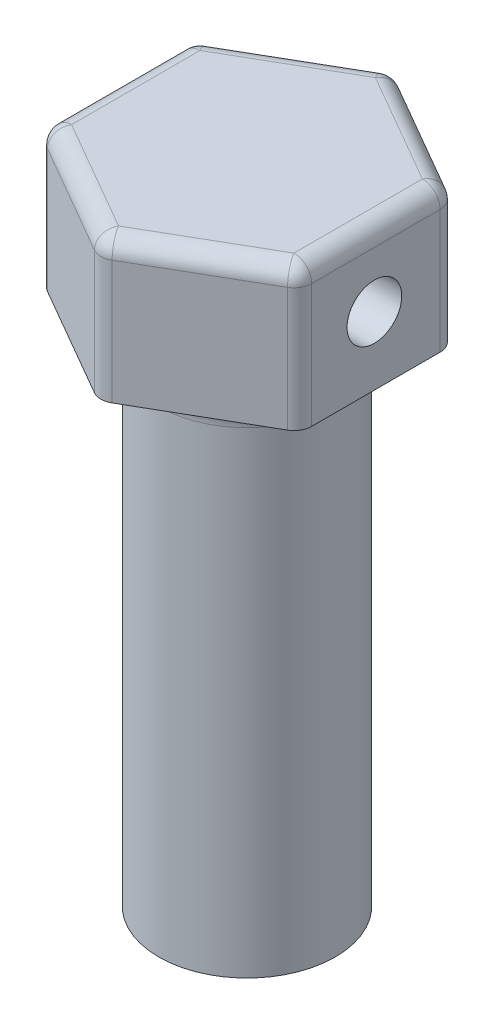
ISO-10303-21;
HEADER;
FILE_DESCRIPTION(('STEP AP214'),'2;1');
FILE_NAME('part.step','',(''),(''),'','','');
FILE_SCHEMA(('AUTOMOTIVE_DESIGN { 1 0 10303 214 1 1 1 1 }'));
ENDSEC;
DATA;
#1=APPLICATION_CONTEXT('core data for automotive mechanical design processes');
#2=APPLICATION_PROTOCOL_DEFINITION('international standard','automotive_design',2000,#1);
#3=PRODUCT_CONTEXT('',#1,'mechanical');
#4=PRODUCT('Part','Part','',(#3));
#5=PRODUCT_RELATED_PRODUCT_CATEGORY('part','',(#4));
#6=PRODUCT_DEFINITION_FORMATION('','',#4);
#7=PRODUCT_DEFINITION_CONTEXT('part definition',#1,'design');
#8=PRODUCT_DEFINITION('design','',#6,#7);
#9=PRODUCT_DEFINITION_SHAPE('','',#8);
#10=(LENGTH_UNIT() NAMED_UNIT(*) SI_UNIT(.MILLI.,.METRE.));
#11=(NAMED_UNIT(*) PLANE_ANGLE_UNIT() SI_UNIT($,.RADIAN.));
#12=(NAMED_UNIT(*) SI_UNIT($,.STERADIAN.) SOLID_ANGLE_UNIT());
#13=UNCERTAINTY_MEASURE_WITH_UNIT(LENGTH_MEASURE(1.E-05),#10,'distance_accuracy_value','');
#14=(GEOMETRIC_REPRESENTATION_CONTEXT(3) GLOBAL_UNCERTAINTY_ASSIGNED_CONTEXT((#13)) GLOBAL_UNIT_ASSIGNED_CONTEXT((#10,
#11,#12)) REPRESENTATION_CONTEXT('',''));
#15=CARTESIAN_POINT('',(0.,0.,0.));
#16=DIRECTION('',(0.,0.,1.));
#17=DIRECTION('',(1.,0.,0.));
#18=AXIS2_PLACEMENT_3D('',#15,#16,#17);
#19=CARTESIAN_POINT('',(-1.5,-29.,1.45177692845699));
#20=DIRECTION('',(1.,0.,0.));
#21=DIRECTION('',(0.,0.,-1.));
#22=AXIS2_PLACEMENT_3D('',#19,#20,#21);
#23=PLANE('',#22);
#24=DIRECTION('',(0.,1.,0.));
#25=VECTOR('',#24,1.);
#26=CARTESIAN_POINT('',(-1.5,-29.,1.45177692845699));
#27=LINE('',#26,#25);
#28=CARTESIAN_POINT('',(-1.5,-26.,1.45177692845699));
#29=VERTEX_POINT('',#28);
#30=CARTESIAN_POINT('',(-1.5,0.,1.45177692845699));
#31=VERTEX_POINT('',#30);
#32=EDGE_CURVE('E176',#29,#31,#27,.T.);
#33=ORIENTED_EDGE('',*,*,#32,.F.);
#34=DIRECTION('',(0.,0.,-1.));
#35=VECTOR('',#34,1.);
#36=CARTESIAN_POINT('',(-1.5,-26.,1.45177692845699));
#37=LINE('',#36,#35);
#38=CARTESIAN_POINT('',(-1.5,-26.,-1.45177692845699));
#39=VERTEX_POINT('',#38);
#40=EDGE_CURVE('E12',#29,#39,#37,.T.);
#41=ORIENTED_EDGE('',*,*,#40,.T.);
#42=DIRECTION('',(0.,1.,0.));
#43=VECTOR('',#42,1.);
#44=CARTESIAN_POINT('',(-1.5,-29.,-1.45177692845699));
#45=LINE('',#44,#43);
#46=CARTESIAN_POINT('',(-1.5,0.,-1.45177692845699));
#47=VERTEX_POINT('',#46);
#48=EDGE_CURVE('E178',#39,#47,#45,.T.);
#49=ORIENTED_EDGE('',*,*,#48,.T.);
#50=DIRECTION('',(0.,0.,-1.));
#51=VECTOR('',#50,1.);
#52=CARTESIAN_POINT('',(-1.5,0.,1.45177692845699));
#53=LINE('',#52,#51);
#54=EDGE_CURVE('E184',#31,#47,#53,.T.);
#55=ORIENTED_EDGE('',*,*,#54,.F.);
#56=EDGE_LOOP('',(#33,#41,#49,#55));
#57=FACE_BOUND('',#56,.T.);
#58=ADVANCED_FACE('F51',(#57),#23,.T.);
#59=CARTESIAN_POINT('',(0.,0.,0.));
#60=DIRECTION('',(0.,1.,0.));
#61=DIRECTION('',(0.,0.,1.));
#62=AXIS2_PLACEMENT_3D('',#59,#60,#61);
#63=PLANE('',#62);
#64=CARTESIAN_POINT('',(0.,0.,0.));
#65=DIRECTION('',(0.,1.,0.));
#66=DIRECTION('',(0.,0.,1.));
#67=AXIS2_PLACEMENT_3D('',#64,#65,#66);
#68=CIRCLE('',#67,7.);
#69=CARTESIAN_POINT('',(0.,0.,7.));
#70=VERTEX_POINT('',#69);
#71=EDGE_CURVE('E224',#70,#70,#68,.T.);
#72=ORIENTED_EDGE('',*,*,#71,.T.);
#73=EDGE_LOOP('',(#72));
#74=FACE_BOUND('',#73,.T.);
#75=DIRECTION('',(0.,0.,1.));
#76=VECTOR('',#75,1.);
#77=CARTESIAN_POINT('',(-7.3,0.,-4.21465696508427));
#78=LINE('',#77,#76);
#79=CARTESIAN_POINT('',(-7.3,0.,-3.63730669589464));
#80=VERTEX_POINT('',#79);
#81=CARTESIAN_POINT('',(-7.3,0.,3.63730669589464));
#82=VERTEX_POINT('',#81);
#83=EDGE_CURVE('E212',#80,#82,#78,.T.);
#84=ORIENTED_EDGE('',*,*,#83,.F.);
#85=CARTESIAN_POINT('',(-6.3,0.,-3.63730669589464));
#86=DIRECTION('',(0.,1.,0.));
#87=DIRECTION('',(0.,0.,1.));
#88=AXIS2_PLACEMENT_3D('',#85,#86,#87);
#89=CIRCLE('',#88,1.);
#90=CARTESIAN_POINT('',(-6.8,0.,-4.50333209967908));
#91=VERTEX_POINT('',#90);
#92=EDGE_CURVE('E60',#80,#91,#89,.F.);
#93=ORIENTED_EDGE('',*,*,#92,.T.);
#94=DIRECTION('',(-0.866025403784439,0.,0.5));
#95=VECTOR('',#94,1.);
#96=CARTESIAN_POINT('',(0.,0.,-8.42931393016854));
#97=LINE('',#96,#95);
#98=CARTESIAN_POINT('',(-0.5,0.,-8.14063879557373));
#99=VERTEX_POINT('',#98);
#100=EDGE_CURVE('E208',#99,#91,#97,.T.);
#101=ORIENTED_EDGE('',*,*,#100,.F.);
#102=CARTESIAN_POINT('',(0.,0.,-7.27461339178929));
#103=DIRECTION('',(0.,1.,0.));
#104=DIRECTION('',(0.,0.,1.));
#105=AXIS2_PLACEMENT_3D('',#102,#103,#104);
#106=CIRCLE('',#105,1.);
#107=CARTESIAN_POINT('',(0.5,0.,-8.14063879557372));
#108=VERTEX_POINT('',#107);
#109=EDGE_CURVE('E313',#99,#108,#106,.F.);
#110=ORIENTED_EDGE('',*,*,#109,.T.);
#111=DIRECTION('',(-0.866025403784439,0.,-0.5));
#112=VECTOR('',#111,1.);
#113=CARTESIAN_POINT('',(7.3,0.,-4.21465696508427));
#114=LINE('',#113,#112);
#115=CARTESIAN_POINT('',(6.8,0.,-4.50333209967908));
#116=VERTEX_POINT('',#115);
#117=EDGE_CURVE('E204',#116,#108,#114,.T.);
#118=ORIENTED_EDGE('',*,*,#117,.F.);
#119=CARTESIAN_POINT('',(6.3,0.,-3.63730669589465));
#120=DIRECTION('',(0.,1.,0.));
#121=DIRECTION('',(0.,0.,1.));
#122=AXIS2_PLACEMENT_3D('',#119,#120,#121);
#123=CIRCLE('',#122,1.);
#124=CARTESIAN_POINT('',(7.3,0.,-3.63730669589465));
#125=VERTEX_POINT('',#124);
#126=EDGE_CURVE('E310',#116,#125,#123,.F.);
#127=ORIENTED_EDGE('',*,*,#126,.T.);
#128=DIRECTION('',(0.,0.,-1.));
#129=VECTOR('',#128,1.);
#130=CARTESIAN_POINT('',(7.3,0.,4.21465696508427));
#131=LINE('',#130,#129);
#132=CARTESIAN_POINT('',(7.3,0.,3.63730669589464));
#133=VERTEX_POINT('',#132);
#134=EDGE_CURVE('E200',#133,#125,#131,.T.);
#135=ORIENTED_EDGE('',*,*,#134,.F.);
#136=CARTESIAN_POINT('',(6.3,0.,3.63730669589464));
#137=DIRECTION('',(0.,1.,0.));
#138=DIRECTION('',(0.,0.,1.));
#139=AXIS2_PLACEMENT_3D('',#136,#137,#138);
#140=CIRCLE('',#139,1.);
#141=CARTESIAN_POINT('',(6.8,0.,4.50333209967908));
#142=VERTEX_POINT('',#141);
#143=EDGE_CURVE('E307',#133,#142,#140,.F.);
#144=ORIENTED_EDGE('',*,*,#143,.T.);
#145=DIRECTION('',(0.866025403784439,0.,-0.5));
#146=VECTOR('',#145,1.);
#147=CARTESIAN_POINT('',(0.,0.,8.42931393016854));
#148=LINE('',#147,#146);
#149=CARTESIAN_POINT('',(0.500000000000001,0.,8.14063879557373));
#150=VERTEX_POINT('',#149);
#151=EDGE_CURVE('E192',#150,#142,#148,.T.);
#152=ORIENTED_EDGE('',*,*,#151,.F.);
#153=CARTESIAN_POINT('',(0.,0.,7.27461339178929));
#154=DIRECTION('',(0.,1.,0.));
#155=DIRECTION('',(0.,0.,1.));
#156=AXIS2_PLACEMENT_3D('',#153,#154,#155);
#157=CIRCLE('',#156,1.);
#158=CARTESIAN_POINT('',(-0.5,0.,8.14063879557373));
#159=VERTEX_POINT('',#158);
#160=EDGE_CURVE('E304',#150,#159,#157,.F.);
#161=ORIENTED_EDGE('',*,*,#160,.T.);
#162=DIRECTION('',(0.866025403784438,0.,0.5));
#163=VECTOR('',#162,1.);
#164=CARTESIAN_POINT('',(-7.3,0.,4.21465696508427));
#165=LINE('',#164,#163);
#166=CARTESIAN_POINT('',(-6.8,0.,4.50333209967908));
#167=VERTEX_POINT('',#166);
#168=EDGE_CURVE('E216',#167,#159,#165,.T.);
#169=ORIENTED_EDGE('',*,*,#168,.F.);
#170=CARTESIAN_POINT('',(-6.3,0.,3.63730669589464));
#171=DIRECTION('',(0.,1.,0.));
#172=DIRECTION('',(0.,0.,1.));
#173=AXIS2_PLACEMENT_3D('',#170,#171,#172);
#174=CIRCLE('',#173,1.);
#175=EDGE_CURVE('E301',#167,#82,#174,.F.);
#176=ORIENTED_EDGE('',*,*,#175,.T.);
#177=EDGE_LOOP('',(#84,#93,#101,#110,#118,#127,#135,#144,#152,#161,#169,#176));
#178=FACE_BOUND('',#177,.T.);
#179=ADVANCED_FACE('F411',(#74,#178),#63,.F.);
#180=CARTESIAN_POINT('',(0.,8.,8.42931393016854));
#181=DIRECTION('',(-0.5,0.,-0.866025403784439));
#182=DIRECTION('',(-0.866025403784439,0.,0.5));
#183=AXIS2_PLACEMENT_3D('',#180,#181,#182);
#184=PLANE('',#183);
#185=ORIENTED_EDGE('',*,*,#151,.T.);
#186=DIRECTION('',(0.,-1.,0.));
#187=VECTOR('',#186,1.);
#188=CARTESIAN_POINT('',(6.8,8.,4.50333209967908));
#189=LINE('',#188,#187);
#190=CARTESIAN_POINT('',(6.8,7.,4.50333209967908));
#191=VERTEX_POINT('',#190);
#192=EDGE_CURVE('E73',#142,#191,#189,.F.);
#193=ORIENTED_EDGE('',*,*,#192,.T.);
#194=DIRECTION('',(0.866025403784439,0.,-0.5));
#195=VECTOR('',#194,1.);
#196=CARTESIAN_POINT('',(0.,7.,8.42931393016854));
#197=LINE('',#196,#195);
#198=CARTESIAN_POINT('',(0.5,7.,8.14063879557373));
#199=VERTEX_POINT('',#198);
#200=EDGE_CURVE('E296',#191,#199,#197,.F.);
#201=ORIENTED_EDGE('',*,*,#200,.T.);
#202=DIRECTION('',(0.,-1.,0.));
#203=VECTOR('',#202,1.);
#204=CARTESIAN_POINT('',(0.5,8.,8.14063879557373));
#205=LINE('',#204,#203);
#206=EDGE_CURVE('E293',#199,#150,#205,.T.);
#207=ORIENTED_EDGE('',*,*,#206,.T.);
#208=EDGE_LOOP('',(#185,#193,#201,#207));
#209=FACE_BOUND('',#208,.T.);
#210=ADVANCED_FACE('F427',(#209),#184,.F.);
#211=CARTESIAN_POINT('',(7.3,8.,4.21465696508427));
#212=DIRECTION('',(-1.,0.,0.));
#213=DIRECTION('',(0.,0.,1.));
#214=AXIS2_PLACEMENT_3D('',#211,#212,#213);
#215=PLANE('',#214);
#216=CARTESIAN_POINT('',(7.3,3.85,0.0853430349157284));
#217=DIRECTION('',(1.,0.,0.));
#218=DIRECTION('',(0.,0.,-1.));
#219=AXIS2_PLACEMENT_3D('',#216,#217,#218);
#220=CIRCLE('',#219,1.55);
#221=CARTESIAN_POINT('',(7.3,3.85,-1.46465696508427));
#222=VERTEX_POINT('',#221);
#223=EDGE_CURVE('E385',#222,#222,#220,.T.);
#224=ORIENTED_EDGE('',*,*,#223,.F.);
#225=EDGE_LOOP('',(#224));
#226=FACE_BOUND('',#225,.T.);
#227=ORIENTED_EDGE('',*,*,#134,.T.);
#228=DIRECTION('',(0.,-1.,0.));
#229=VECTOR('',#228,1.);
#230=CARTESIAN_POINT('',(7.3,8.,-3.63730669589465));
#231=LINE('',#230,#229);
#232=CARTESIAN_POINT('',(7.3,7.,-3.63730669589465));
#233=VERTEX_POINT('',#232);
#234=EDGE_CURVE('E290',#125,#233,#231,.F.);
#235=ORIENTED_EDGE('',*,*,#234,.T.);
#236=DIRECTION('',(0.,0.,-1.));
#237=VECTOR('',#236,1.);
#238=CARTESIAN_POINT('',(7.3,7.,4.21465696508427));
#239=LINE('',#238,#237);
#240=CARTESIAN_POINT('',(7.3,7.,3.63730669589464));
#241=VERTEX_POINT('',#240);
#242=EDGE_CURVE('E287',#233,#241,#239,.F.);
#243=ORIENTED_EDGE('',*,*,#242,.T.);
#244=DIRECTION('',(0.,-1.,0.));
#245=VECTOR('',#244,1.);
#246=CARTESIAN_POINT('',(7.3,8.,3.63730669589464));
#247=LINE('',#246,#245);
#248=EDGE_CURVE('E284',#241,#133,#247,.T.);
#249=ORIENTED_EDGE('',*,*,#248,.T.);
#250=EDGE_LOOP('',(#227,#235,#243,#249));
#251=FACE_BOUND('',#250,.T.);
#252=ADVANCED_FACE('F492',(#226,#251),#215,.F.);
#253=CARTESIAN_POINT('',(7.3,8.,-4.21465696508427));
#254=DIRECTION('',(-0.5,0.,0.866025403784439));
#255=DIRECTION('',(0.866025403784439,0.,0.5));
#256=AXIS2_PLACEMENT_3D('',#253,#254,#255);
#257=PLANE('',#256);
#258=CARTESIAN_POINT('',(3.65,3.5,-6.3219854476264));
#259=DIRECTION('',(0.5,0.,-0.866025403784439));
#260=DIRECTION('',(-0.866025403784439,0.,-0.5));
#261=AXIS2_PLACEMENT_3D('',#258,#259,#260);
#262=CIRCLE('',#261,0.5);
#263=CARTESIAN_POINT('',(3.21698729810778,3.5,-6.5719854476264));
#264=VERTEX_POINT('',#263);
#265=EDGE_CURVE('E823',#264,#264,#262,.T.);
#266=ORIENTED_EDGE('',*,*,#265,.F.);
#267=EDGE_LOOP('',(#266));
#268=FACE_BOUND('',#267,.T.);
#269=ORIENTED_EDGE('',*,*,#117,.T.);
#270=DIRECTION('',(0.,-1.,0.));
#271=VECTOR('',#270,1.);
#272=CARTESIAN_POINT('',(0.5,8.,-8.14063879557372));
#273=LINE('',#272,#271);
#274=CARTESIAN_POINT('',(0.499999999999999,7.,-8.14063879557372));
#275=VERTEX_POINT('',#274);
#276=EDGE_CURVE('E281',#108,#275,#273,.F.);
#277=ORIENTED_EDGE('',*,*,#276,.T.);
#278=DIRECTION('',(-0.866025403784439,0.,-0.5));
#279=VECTOR('',#278,1.);
#280=CARTESIAN_POINT('',(7.3,7.,-4.21465696508427));
#281=LINE('',#280,#279);
#282=CARTESIAN_POINT('',(6.8,7.,-4.50333209967908));
#283=VERTEX_POINT('',#282);
#284=EDGE_CURVE('E278',#275,#283,#281,.F.);
#285=ORIENTED_EDGE('',*,*,#284,.T.);
#286=DIRECTION('',(0.,-1.,0.));
#287=VECTOR('',#286,1.);
#288=CARTESIAN_POINT('',(6.8,8.,-4.50333209967908));
#289=LINE('',#288,#287);
#290=EDGE_CURVE('E275',#283,#116,#289,.T.);
#291=ORIENTED_EDGE('',*,*,#290,.T.);
#292=EDGE_LOOP('',(#269,#277,#285,#291));
#293=FACE_BOUND('',#292,.T.);
#294=ADVANCED_FACE('F540',(#268,#293),#257,.F.);
#295=CARTESIAN_POINT('',(0.,8.,-8.42931393016854));
#296=DIRECTION('',(0.5,0.,0.866025403784439));
#297=DIRECTION('',(0.866025403784439,0.,-0.5));
#298=AXIS2_PLACEMENT_3D('',#295,#296,#297);
#299=PLANE('',#298);
#300=ORIENTED_EDGE('',*,*,#100,.T.);
#301=DIRECTION('',(0.,-1.,0.));
#302=VECTOR('',#301,1.);
#303=CARTESIAN_POINT('',(-6.8,8.,-4.50333209967908));
#304=LINE('',#303,#302);
#305=CARTESIAN_POINT('',(-6.8,7.,-4.50333209967908));
#306=VERTEX_POINT('',#305);
#307=EDGE_CURVE('E272',#91,#306,#304,.F.);
#308=ORIENTED_EDGE('',*,*,#307,.T.);
#309=DIRECTION('',(-0.866025403784439,0.,0.5));
#310=VECTOR('',#309,1.);
#311=CARTESIAN_POINT('',(0.,7.,-8.42931393016854));
#312=LINE('',#311,#310);
#313=CARTESIAN_POINT('',(-0.500000000000001,7.,-8.14063879557373));
#314=VERTEX_POINT('',#313);
#315=EDGE_CURVE('E269',#306,#314,#312,.F.);
#316=ORIENTED_EDGE('',*,*,#315,.T.);
#317=DIRECTION('',(0.,-1.,0.));
#318=VECTOR('',#317,1.);
#319=CARTESIAN_POINT('',(-0.500000000000001,8.,-8.14063879557373));
#320=LINE('',#319,#318);
#321=EDGE_CURVE('E266',#314,#99,#320,.T.);
#322=ORIENTED_EDGE('',*,*,#321,.T.);
#323=EDGE_LOOP('',(#300,#308,#316,#322));
#324=FACE_BOUND('',#323,.T.);
#325=ADVANCED_FACE('F590',(#324),#299,.F.);
#326=CARTESIAN_POINT('',(-7.3,8.,-4.21465696508427));
#327=DIRECTION('',(1.,0.,0.));
#328=DIRECTION('',(0.,0.,-1.));
#329=AXIS2_PLACEMENT_3D('',#326,#327,#328);
#330=PLANE('',#329);
#331=CARTESIAN_POINT('',(-7.3,3.85,0.0853430349157314));
#332=DIRECTION('',(1.,0.,0.));
#333=DIRECTION('',(0.,0.,-1.));
#334=AXIS2_PLACEMENT_3D('',#331,#332,#333);
#335=CIRCLE('',#334,1.55);
#336=CARTESIAN_POINT('',(-7.3,3.85,-1.46465696508427));
#337=VERTEX_POINT('',#336);
#338=EDGE_CURVE('E391',#337,#337,#335,.T.);
#339=ORIENTED_EDGE('',*,*,#338,.T.);
#340=EDGE_LOOP('',(#339));
#341=FACE_BOUND('',#340,.T.);
#342=DIRECTION('',(0.,0.,1.));
#343=VECTOR('',#342,1.);
#344=CARTESIAN_POINT('',(-7.3,7.,-4.21465696508427));
#345=LINE('',#344,#343);
#346=CARTESIAN_POINT('',(-7.3,7.,3.63730669589464));
#347=VERTEX_POINT('',#346);
#348=CARTESIAN_POINT('',(-7.3,7.,-3.63730669589464));
#349=VERTEX_POINT('',#348);
#350=EDGE_CURVE('E260',#347,#349,#345,.F.);
#351=ORIENTED_EDGE('',*,*,#350,.T.);
#352=DIRECTION('',(0.,-1.,0.));
#353=VECTOR('',#352,1.);
#354=CARTESIAN_POINT('',(-7.3,8.,-3.63730669589464));
#355=LINE('',#354,#353);
#356=EDGE_CURVE('E263',#349,#80,#355,.T.);
#357=ORIENTED_EDGE('',*,*,#356,.T.);
#358=ORIENTED_EDGE('',*,*,#83,.T.);
#359=DIRECTION('',(0.,-1.,0.));
#360=VECTOR('',#359,1.);
#361=CARTESIAN_POINT('',(-7.3,8.,3.63730669589464));
#362=LINE('',#361,#360);
#363=EDGE_CURVE('E257',#82,#347,#362,.F.);
#364=ORIENTED_EDGE('',*,*,#363,.T.);
#365=EDGE_LOOP('',(#351,#357,#358,#364));
#366=FACE_BOUND('',#365,.T.);
#367=ADVANCED_FACE('F449',(#341,#366),#330,.F.);
#368=CARTESIAN_POINT('',(-7.3,8.,4.21465696508427));
#369=DIRECTION('',(0.5,0.,-0.866025403784439));
#370=DIRECTION('',(-0.866025403784438,0.,-0.5));
#371=AXIS2_PLACEMENT_3D('',#368,#369,#370);
#372=PLANE('',#371);
#373=ORIENTED_EDGE('',*,*,#168,.T.);
#374=DIRECTION('',(0.,-1.,0.));
#375=VECTOR('',#374,1.);
#376=CARTESIAN_POINT('',(-0.5,8.,8.14063879557373));
#377=LINE('',#376,#375);
#378=CARTESIAN_POINT('',(-0.5,7.,8.14063879557373));
#379=VERTEX_POINT('',#378);
#380=EDGE_CURVE('E254',#159,#379,#377,.F.);
#381=ORIENTED_EDGE('',*,*,#380,.T.);
#382=DIRECTION('',(0.866025403784438,0.,0.5));
#383=VECTOR('',#382,1.);
#384=CARTESIAN_POINT('',(-7.3,7.,4.21465696508427));
#385=LINE('',#384,#383);
#386=CARTESIAN_POINT('',(-6.8,7.,4.50333209967908));
#387=VERTEX_POINT('',#386);
#388=EDGE_CURVE('E250',#379,#387,#385,.F.);
#389=ORIENTED_EDGE('',*,*,#388,.T.);
#390=DIRECTION('',(0.,-1.,0.));
#391=VECTOR('',#390,1.);
#392=CARTESIAN_POINT('',(-6.8,8.,4.50333209967908));
#393=LINE('',#392,#391);
#394=EDGE_CURVE('E247',#387,#167,#393,.T.);
#395=ORIENTED_EDGE('',*,*,#394,.T.);
#396=EDGE_LOOP('',(#373,#381,#389,#395));
#397=FACE_BOUND('',#396,.T.);
#398=ADVANCED_FACE('F444',(#397),#372,.F.);
#399=CARTESIAN_POINT('',(0.,8.,0.));
#400=DIRECTION('',(0.,1.,0.));
#401=DIRECTION('',(0.,0.,1.));
#402=AXIS2_PLACEMENT_3D('',#399,#400,#401);
#403=PLANE('',#402);
#404=DIRECTION('',(0.,0.,1.));
#405=VECTOR('',#404,1.);
#406=CARTESIAN_POINT('',(-6.3,8.,4.21465696508427));
#407=LINE('',#406,#405);
#408=CARTESIAN_POINT('',(-6.3,8.,-3.63730669589464));
#409=VERTEX_POINT('',#408);
#410=CARTESIAN_POINT('',(-6.3,8.,3.63730669589464));
#411=VERTEX_POINT('',#410);
#412=EDGE_CURVE('E240',#409,#411,#407,.T.);
#413=ORIENTED_EDGE('',*,*,#412,.T.);
#414=DIRECTION('',(0.866025403784438,0.,0.5));
#415=VECTOR('',#414,1.);
#416=CARTESIAN_POINT('',(0.499999999999999,8.,7.5632885263841));
#417=LINE('',#416,#415);
#418=CARTESIAN_POINT('',(0.,8.,7.27461339178929));
#419=VERTEX_POINT('',#418);
#420=EDGE_CURVE('E243',#411,#419,#417,.T.);
#421=ORIENTED_EDGE('',*,*,#420,.T.);
#422=DIRECTION('',(0.866025403784439,0.,-0.5));
#423=VECTOR('',#422,1.);
#424=CARTESIAN_POINT('',(6.8,8.,3.34863156129983));
#425=LINE('',#424,#423);
#426=CARTESIAN_POINT('',(6.3,8.,3.63730669589465));
#427=VERTEX_POINT('',#426);
#428=EDGE_CURVE('E228',#419,#427,#425,.T.);
#429=ORIENTED_EDGE('',*,*,#428,.T.);
#430=DIRECTION('',(0.,0.,-1.));
#431=VECTOR('',#430,1.);
#432=CARTESIAN_POINT('',(6.3,8.,-4.21465696508427));
#433=LINE('',#432,#431);
#434=CARTESIAN_POINT('',(6.3,8.,-3.63730669589465));
#435=VERTEX_POINT('',#434);
#436=EDGE_CURVE('E231',#427,#435,#433,.T.);
#437=ORIENTED_EDGE('',*,*,#436,.T.);
#438=DIRECTION('',(-0.866025403784439,0.,-0.5));
#439=VECTOR('',#438,1.);
#440=CARTESIAN_POINT('',(-0.500000000000001,8.,-7.5632885263841));
#441=LINE('',#440,#439);
#442=CARTESIAN_POINT('',(0.,8.,-7.27461339178929));
#443=VERTEX_POINT('',#442);
#444=EDGE_CURVE('E234',#435,#443,#441,.T.);
#445=ORIENTED_EDGE('',*,*,#444,.T.);
#446=DIRECTION('',(-0.866025403784439,0.,0.5));
#447=VECTOR('',#446,1.);
#448=CARTESIAN_POINT('',(-6.8,8.,-3.34863156129983));
#449=LINE('',#448,#447);
#450=EDGE_CURVE('E237',#443,#409,#449,.T.);
#451=ORIENTED_EDGE('',*,*,#450,.T.);
#452=EDGE_LOOP('',(#413,#421,#429,#437,#445,#451));
#453=FACE_BOUND('',#452,.T.);
#454=ADVANCED_FACE('F439',(#453),#403,.T.);
#455=CARTESIAN_POINT('',(0.,-29.,0.));
#456=DIRECTION('',(0.,-1.,0.));
#457=DIRECTION('',(0.,0.,-1.));
#458=AXIS2_PLACEMENT_3D('',#455,#456,#457);
#459=PLANE('',#458);
#460=CARTESIAN_POINT('',(0.,-29.,0.));
#461=DIRECTION('',(0.,-1.,0.));
#462=DIRECTION('',(0.,0.,-1.));
#463=AXIS2_PLACEMENT_3D('',#460,#461,#462);
#464=CIRCLE('',#463,2.0875);
#465=CARTESIAN_POINT('',(0.,-29.,-2.0875));
#466=VERTEX_POINT('',#465);
#467=EDGE_CURVE('E194',#466,#466,#464,.T.);
#468=ORIENTED_EDGE('',*,*,#467,.F.);
#469=EDGE_LOOP('',(#468));
#470=FACE_BOUND('',#469,.T.);
#471=CARTESIAN_POINT('',(0.,-29.,0.));
#472=DIRECTION('',(0.,-1.,0.));
#473=DIRECTION('',(0.,0.,-1.));
#474=AXIS2_PLACEMENT_3D('',#471,#472,#473);
#475=CIRCLE('',#474,5.);
#476=CARTESIAN_POINT('',(0.,-29.,-5.));
#477=VERTEX_POINT('',#476);
#478=EDGE_CURVE('E187',#477,#477,#475,.T.);
#479=ORIENTED_EDGE('',*,*,#478,.T.);
#480=EDGE_LOOP('',(#479));
#481=FACE_BOUND('',#480,.T.);
#482=ADVANCED_FACE('F436',(#470,#481),#459,.T.);
#483=CARTESIAN_POINT('',(0.,-29.,0.));
#484=DIRECTION('',(0.,1.,0.));
#485=DIRECTION('',(0.,0.,1.));
#486=AXIS2_PLACEMENT_3D('',#483,#484,#485);
#487=CYLINDRICAL_SURFACE('',#486,5.);
#488=CARTESIAN_POINT('',(0.,-2.,0.));
#489=DIRECTION('',(0.,1.,0.));
#490=DIRECTION('',(0.,0.,1.));
#491=AXIS2_PLACEMENT_3D('',#488,#489,#490);
#492=CIRCLE('',#491,5.);
#493=CARTESIAN_POINT('',(0.,-2.,5.));
#494=VERTEX_POINT('',#493);
#495=EDGE_CURVE('E220',#494,#494,#492,.F.);
#496=ORIENTED_EDGE('',*,*,#495,.T.);
#497=EDGE_LOOP('',(#496));
#498=FACE_BOUND('',#497,.T.);
#499=ORIENTED_EDGE('',*,*,#478,.F.);
#500=EDGE_LOOP('',(#499));
#501=FACE_BOUND('',#500,.T.);
#502=ADVANCED_FACE('F421',(#498,#501),#487,.T.);
#503=CARTESIAN_POINT('',(0.,-29.,0.));
#504=DIRECTION('',(0.,1.,0.));
#505=DIRECTION('',(0.,0.,1.));
#506=AXIS2_PLACEMENT_3D('',#503,#504,#505);
#507=CYLINDRICAL_SURFACE('',#506,2.0875);
#508=CARTESIAN_POINT('',(0.,-26.,0.));
#509=DIRECTION('',(0.,-1.,0.));
#510=DIRECTION('',(0.,0.,-1.));
#511=AXIS2_PLACEMENT_3D('',#508,#509,#510);
#512=CIRCLE('',#511,2.0875);
#513=EDGE_CURVE('E66',#29,#39,#512,.T.);
#514=ORIENTED_EDGE('',*,*,#513,.F.);
#515=ORIENTED_EDGE('',*,*,#32,.T.);
#516=CARTESIAN_POINT('',(0.,0.,0.));
#517=DIRECTION('',(0.,-1.,0.));
#518=DIRECTION('',(0.,0.,-1.));
#519=AXIS2_PLACEMENT_3D('',#516,#517,#518);
#520=CIRCLE('',#519,2.0875);
#521=EDGE_CURVE('E397',#47,#31,#520,.T.);
#522=ORIENTED_EDGE('',*,*,#521,.F.);
#523=ORIENTED_EDGE('',*,*,#48,.F.);
#524=EDGE_LOOP('',(#514,#515,#522,#523));
#525=FACE_BOUND('',#524,.T.);
#526=ORIENTED_EDGE('',*,*,#467,.T.);
#527=EDGE_LOOP('',(#526));
#528=FACE_BOUND('',#527,.T.);
#529=ADVANCED_FACE('F173',(#525,#528),#507,.F.);
#530=CARTESIAN_POINT('',(0.,0.,0.));
#531=DIRECTION('',(0.,-1.,0.));
#532=DIRECTION('',(0.,0.,-1.));
#533=AXIS2_PLACEMENT_3D('',#530,#531,#532);
#534=CIRCLE('',#533,1.25);
#535=CARTESIAN_POINT('',(0.,0.,-1.25));
#536=VERTEX_POINT('',#535);
#537=EDGE_CURVE('E818',#536,#536,#534,.T.);
#538=ORIENTED_EDGE('',*,*,#537,.F.);
#539=EDGE_LOOP('',(#538));
#540=FACE_BOUND('',#539,.T.);
#541=ORIENTED_EDGE('',*,*,#54,.T.);
#542=ORIENTED_EDGE('',*,*,#521,.T.);
#543=EDGE_LOOP('',(#541,#542));
#544=FACE_BOUND('',#543,.T.);
#545=ADVANCED_FACE('F406',(#540,#544),#63,.F.);
#546=CARTESIAN_POINT('',(0.,-2.,0.));
#547=DIRECTION('',(0.,1.,0.));
#548=DIRECTION('',(0.,0.,1.));
#549=AXIS2_PLACEMENT_3D('',#546,#547,#548);
#550=TOROIDAL_SURFACE('',#549,7.,2.);
#551=ORIENTED_EDGE('',*,*,#71,.F.);
#552=EDGE_LOOP('',(#551));
#553=FACE_BOUND('',#552,.T.);
#554=ORIENTED_EDGE('',*,*,#495,.F.);
#555=EDGE_LOOP('',(#554));
#556=FACE_BOUND('',#555,.T.);
#557=ADVANCED_FACE('F408',(#553,#556),#550,.F.);
#558=CARTESIAN_POINT('',(-7.3,3.85,0.0853430349157314));
#559=DIRECTION('',(1.,0.,0.));
#560=DIRECTION('',(0.,0.,-1.));
#561=AXIS2_PLACEMENT_3D('',#558,#559,#560);
#562=CYLINDRICAL_SURFACE('',#561,1.55);
#563=CARTESIAN_POINT('',(0.,3.06300636654288,-1.25));
#564=CARTESIAN_POINT('',(-0.041301602564252,3.06299111492104,-1.24999440582926));
#565=CARTESIAN_POINT('',(-0.0826622150684468,3.0594538669413,-1.24792546989775));
#566=CARTESIAN_POINT('',(-0.164001472993008,3.04604216997584,-1.23987619935768));
#567=CARTESIAN_POINT('',(-0.203974352426859,3.0361439988587,-1.2338812215485));
#568=CARTESIAN_POINT('',(-0.297768283430284,3.0066629309098,-1.21530713048835));
#569=CARTESIAN_POINT('',(-0.350500531746376,2.98476935700799,-1.20103218379735));
#570=CARTESIAN_POINT('',(-0.451616903849389,2.93591949181999,-1.16679545456734));
#571=CARTESIAN_POINT('',(-0.499985468125294,2.90894606685875,-1.14681430439653));
#572=CARTESIAN_POINT('',(-0.582825744681604,2.85868688918029,-1.10654884109417));
#573=CARTESIAN_POINT('',(-0.618055934314941,2.83584766769323,-1.08724493279857));
#574=CARTESIAN_POINT('',(-0.686226700680422,2.78955837602196,-1.04555763913344));
#575=CARTESIAN_POINT('',(-0.719166048979597,2.76610798723252,-1.02317262043568));
#576=CARTESIAN_POINT('',(-0.814571303194274,2.69589232391681,-0.951475007372201));
#577=CARTESIAN_POINT('',(-0.873750007842423,2.64918109284241,-0.897558288556876));
#578=CARTESIAN_POINT('',(-0.971488906178606,2.56890613771982,-0.789257858005671));
#579=CARTESIAN_POINT('',(-1.01181688646501,2.53456002585319,-0.737037213084417));
#580=CARTESIAN_POINT('',(-1.08471295560267,2.47073866753222,-0.624786077485593));
#581=CARTESIAN_POINT('',(-1.11729471450697,2.44125486897378,-0.564769638274936));
#582=CARTESIAN_POINT('',(-1.167641642544,2.39422627473518,-0.44974479942497));
#583=CARTESIAN_POINT('',(-1.18704559294464,2.37547748483155,-0.39595023001308));
#584=CARTESIAN_POINT('',(-1.21853292020641,2.34369335632691,-0.284631892689434));
#585=CARTESIAN_POINT('',(-1.23062054965173,2.33065469995304,-0.227110312656472));
#586=CARTESIAN_POINT('',(-1.24661326429393,2.31113649235983,-0.109509199862149));
#587=CARTESIAN_POINT('',(-1.25047520310349,2.30469161886726,-0.0494178574345837));
#588=CARTESIAN_POINT('',(-1.24943138675887,2.29889486219123,0.0710290436026361));
#589=CARTESIAN_POINT('',(-1.24452751099986,2.29954145874558,0.131384542809408));
#590=CARTESIAN_POINT('',(-1.22695347852354,2.30729911417111,0.24518809568316));
#591=CARTESIAN_POINT('',(-1.21498195318294,2.31385367785997,0.298786010533986));
#592=CARTESIAN_POINT('',(-1.1844500714156,2.33200739719698,0.403158403366509));
#593=CARTESIAN_POINT('',(-1.16588828894205,2.34360764478855,0.453932267507391));
#594=CARTESIAN_POINT('',(-1.12158352847451,2.37180931066153,0.554771879228037));
#595=CARTESIAN_POINT('',(-1.09546489770609,2.38867750288334,0.604595997769054));
#596=CARTESIAN_POINT('',(-1.03753278519779,2.42589667043423,0.699367532517902));
#597=CARTESIAN_POINT('',(-1.00571686210665,2.44624913864812,0.744312844790786));
#598=CARTESIAN_POINT('',(-0.930754373015022,2.49321878202419,0.836883641045511));
#599=CARTESIAN_POINT('',(-0.886600835684749,2.52029754043777,0.883457693130686));
#600=CARTESIAN_POINT('',(-0.792086036047711,2.57561506085479,0.969110902997212));
#601=CARTESIAN_POINT('',(-0.741716379711889,2.60385535630042,1.00817974002343));
#602=CARTESIAN_POINT('',(-0.635250560153108,2.65909387309691,1.07843523226006));
#603=CARTESIAN_POINT('',(-0.579163389493455,2.68609395092517,1.10963400500563));
#604=CARTESIAN_POINT('',(-0.461317477328724,2.73586502755761,1.16355750147167));
#605=CARTESIAN_POINT('',(-0.399570339829453,2.75864440204024,1.18629910020061));
#606=CARTESIAN_POINT('',(-0.289023624094293,2.79073586882606,1.21707218664435));
#607=CARTESIAN_POINT('',(-0.241465831680964,2.80203371981421,1.22744190826755));
#608=CARTESIAN_POINT('',(-0.144498249650106,2.81877586710317,1.24258476451287));
#609=CARTESIAN_POINT('',(-0.0950924232428492,2.82423202135642,1.24736923831762));
#610=CARTESIAN_POINT('',(0.00445642144024292,2.82834265658563,1.25098724929806));
#611=CARTESIAN_POINT('',(0.0546017283901357,2.82696706996175,1.24979447944687));
#612=CARTESIAN_POINT('',(0.153795785432793,2.8176118512109,1.24150447845168));
#613=CARTESIAN_POINT('',(0.202842926001359,2.80962310395748,1.23439909770023));
#614=CARTESIAN_POINT('',(0.310586008250744,2.78571905625046,1.21234188476512));
#615=CARTESIAN_POINT('',(0.368630837493627,2.7683219786457,1.1958731423359));
#616=CARTESIAN_POINT('',(0.480287315114382,2.72844194014306,1.15558131462972));
#617=CARTESIAN_POINT('',(0.533885920465583,2.7059446917523,1.13173749928649));
#618=CARTESIAN_POINT('',(0.652788790300151,2.65097323161605,1.06875051004666));
#619=CARTESIAN_POINT('',(0.716378614292974,2.61760460231739,1.02715323487059));
#620=CARTESIAN_POINT('',(0.835116282947256,2.55115023144684,0.933169083235592));
#621=CARTESIAN_POINT('',(0.890267871057291,2.51806437061705,0.880787015560401));
#622=CARTESIAN_POINT('',(0.982774695823851,2.4608378561669,0.775072838146119));
#623=CARTESIAN_POINT('',(1.0215650415802,2.43612088674925,0.723313160391291));
#624=CARTESIAN_POINT('',(1.0913329560333,2.39135839845994,0.612973520335291));
#625=CARTESIAN_POINT('',(1.12232277536251,2.37130555844017,0.55440446627615));
#626=CARTESIAN_POINT('',(1.1708427785569,2.34048718437041,0.441339820015366));
#627=CARTESIAN_POINT('',(1.18973442532783,2.32874801210213,0.387697084794267));
#628=CARTESIAN_POINT('',(1.22015766134809,2.31094012641843,0.27744961897616));
#629=CARTESIAN_POINT('',(1.23169327074564,2.30486831489064,0.220846524578993));
#630=CARTESIAN_POINT('',(1.24684031414995,2.29907071043569,0.106065229892042));
#631=CARTESIAN_POINT('',(1.25042577912291,2.29936568093521,0.0478824942578681));
#632=CARTESIAN_POINT('',(1.24949319540504,2.30651245072849,-0.0680101134761316));
#633=CARTESIAN_POINT('',(1.24497467785291,2.31336462938319,-0.125719958022474));
#634=CARTESIAN_POINT('',(1.22871845036683,2.33269715741431,-0.236012488907826));
#635=CARTESIAN_POINT('',(1.21736023392209,2.34487300838407,-0.288706600122438));
#636=CARTESIAN_POINT('',(1.18847929897974,2.37403431774048,-0.390952244104959));
#637=CARTESIAN_POINT('',(1.17095479350189,2.39102117006857,-0.440502860975093));
#638=CARTESIAN_POINT('',(1.12351482384541,2.43556264214724,-0.552337811219016));
#639=CARTESIAN_POINT('',(1.09140957041027,2.46473751619082,-0.613050051710613));
#640=CARTESIAN_POINT('',(1.01929496938293,2.52812615839134,-0.726698595015945));
#641=CARTESIAN_POINT('',(0.97926642826102,2.56235211012177,-0.779615460251271));
#642=CARTESIAN_POINT('',(0.882047019739425,2.6425460023073,-0.889447540206268));
#643=CARTESIAN_POINT('',(0.823052922014887,2.68933873555993,-0.944176584708209));
#644=CARTESIAN_POINT('',(0.727904353195899,2.75980071328673,-1.016979341121));
#645=CARTESIAN_POINT('',(0.695069980266153,2.78333915701303,-1.03970276240477));
#646=CARTESIAN_POINT('',(0.62710543645588,2.82986774709269,-1.08205409680024));
#647=CARTESIAN_POINT('',(0.591976629500797,2.85285820829624,-1.10168382568988));
#648=CARTESIAN_POINT('',(0.514960296474335,2.9001062764203,-1.13990369364796));
#649=CARTESIAN_POINT('',(0.472765383445809,2.9241905799731,-1.15809414892484));
#650=CARTESIAN_POINT('',(0.385000888161593,2.96887691161605,-1.19014711585965));
#651=CARTESIAN_POINT('',(0.339436094087831,2.98948374905308,-1.20401562764763));
#652=CARTESIAN_POINT('',(0.254778861108675,3.02087449148682,-1.22436136834602));
#653=CARTESIAN_POINT('',(0.21635456554201,3.03281405524104,-1.23178134440185));
#654=CARTESIAN_POINT('',(0.137748348571973,3.05119434659299,-1.24301384722023));
#655=CARTESIAN_POINT('',(0.0975734929845747,3.0576553532976,-1.24683968356819));
#656=CARTESIAN_POINT('',(0.0381123091281284,3.06227018461342,-1.24956562801693));
#657=CARTESIAN_POINT('',(0.0190624397530193,3.06301340581265,-1.25000258194685));
#658=CARTESIAN_POINT('',(0.,3.06300636654288,-1.25));
#659=B_SPLINE_CURVE_WITH_KNOTS('',3,(#563,#564,#565,#566,#567,#568,#569,#570,#571,#572,#573,
#574,#575,#576,#577,#578,#579,#580,#581,#582,#583,#584,#585,#586,#587,#588,#589,#590,#591,#592,
#593,#594,#595,#596,#597,#598,#599,#600,#601,#602,#603,#604,#605,#606,#607,#608,#609,#610,#611,
#612,#613,#614,#615,#616,#617,#618,#619,#620,#621,#622,#623,#624,#625,#626,#627,#628,#629,#630,
#631,#632,#633,#634,#635,#636,#637,#638,#639,#640,#641,#642,#643,#644,#645,#646,#647,#648,#649,
#650,#651,#652,#653,#654,#655,#656,#657,#658),.UNSPECIFIED.,.T.,.F.,(4,2,2,2,2,2,2,2,2,2,2,2,2,
2,2,2,2,2,2,2,2,2,2,2,2,2,2,2,2,2,2,2,2,2,2,2,2,2,2,2,2,2,2,2,2,2,2,4),(0.,0.123830746205279,
0.248126002330307,0.423690056025674,0.599857228286685,0.738315252366816,0.876846959196072,
1.15343026564869,1.37579976761269,1.59777388333968,1.77758833210166,1.95729816376851,
2.13794833311325,2.31855977561389,2.48375484721279,2.64898568670622,2.82452086182519,
3.00013143644635,3.20834316302664,3.41683919276093,3.62501221439853,3.8327676007825,
3.98210140065395,4.1311314925218,4.28081806972682,4.43071130882835,4.61805634751958,
4.80593284139443,5.05369427590659,5.30134547548596,5.50827605835075,5.71487960261002,
5.88835283740074,6.06173118589376,6.23567504313533,6.40962896433913,6.57472115629126,
6.7398612311419,6.96249015098085,7.18566512124171,7.46341028088888,7.60234905269665,
7.74120597114662,7.89653808312062,8.05165357769554,8.17397631813597,8.2958442743642,
8.35299741110841),.UNSPECIFIED.);
#660=CARTESIAN_POINT('',(0.,3.06300636654288,-1.25));
#661=VERTEX_POINT('',#660);
#662=EDGE_CURVE('E181',#661,#661,#659,.T.);
#663=ORIENTED_EDGE('',*,*,#662,.F.);
#664=EDGE_LOOP('',(#663));
#665=FACE_BOUND('',#664,.T.);
#666=ORIENTED_EDGE('',*,*,#338,.F.);
#667=EDGE_LOOP('',(#666));
#668=FACE_BOUND('',#667,.T.);
#669=ORIENTED_EDGE('',*,*,#223,.T.);
#670=EDGE_LOOP('',(#669));
#671=FACE_BOUND('',#670,.T.);
#672=ADVANCED_FACE('F417',(#665,#668,#671),#562,.F.);
#673=CARTESIAN_POINT('',(0.,8.,-7.27461339178929));
#674=DIRECTION('',(0.,-1.,0.));
#675=DIRECTION('',(0.,0.,-1.));
#676=AXIS2_PLACEMENT_3D('',#673,#674,#675);
#677=CYLINDRICAL_SURFACE('',#676,1.);
#678=ORIENTED_EDGE('',*,*,#109,.F.);
#679=ORIENTED_EDGE('',*,*,#321,.F.);
#680=CARTESIAN_POINT('',(0.,7.,-7.27461339178929));
#681=DIRECTION('',(0.,1.,0.));
#682=DIRECTION('',(0.,0.,1.));
#683=AXIS2_PLACEMENT_3D('',#680,#681,#682);
#684=CIRCLE('',#683,1.);
#685=EDGE_CURVE('E382',#275,#314,#684,.T.);
#686=ORIENTED_EDGE('',*,*,#685,.F.);
#687=ORIENTED_EDGE('',*,*,#276,.F.);
#688=EDGE_LOOP('',(#678,#679,#686,#687));
#689=FACE_BOUND('',#688,.T.);
#690=ADVANCED_FACE('F53',(#689),#677,.T.);
#691=CARTESIAN_POINT('',(3.15,7.,-5.45596004384197));
#692=DIRECTION('',(0.866025403784439,0.,0.5));
#693=DIRECTION('',(0.5,0.,-0.866025403784439));
#694=AXIS2_PLACEMENT_3D('',#691,#692,#693);
#695=CYLINDRICAL_SURFACE('',#694,1.);
#696=CARTESIAN_POINT('',(6.3,7.,-3.63730669589465));
#697=DIRECTION('',(0.866025403784439,0.,0.5));
#698=DIRECTION('',(0.5,0.,-0.866025403784439));
#699=AXIS2_PLACEMENT_3D('',#696,#697,#698);
#700=CIRCLE('',#699,1.);
#701=EDGE_CURVE('E375',#283,#435,#700,.T.);
#702=ORIENTED_EDGE('',*,*,#701,.F.);
#703=ORIENTED_EDGE('',*,*,#284,.F.);
#704=CARTESIAN_POINT('',(0.,7.,-7.27461339178929));
#705=DIRECTION('',(-0.866025403784438,0.,-0.5));
#706=DIRECTION('',(-0.5,0.,0.866025403784439));
#707=AXIS2_PLACEMENT_3D('',#704,#705,#706);
#708=CIRCLE('',#707,1.);
#709=EDGE_CURVE('E379',#443,#275,#708,.T.);
#710=ORIENTED_EDGE('',*,*,#709,.F.);
#711=ORIENTED_EDGE('',*,*,#444,.F.);
#712=EDGE_LOOP('',(#702,#703,#710,#711));
#713=FACE_BOUND('',#712,.T.);
#714=ADVANCED_FACE('F508',(#713),#695,.T.);
#715=CARTESIAN_POINT('',(6.3,8.,-3.63730669589465));
#716=DIRECTION('',(0.,-1.,0.));
#717=DIRECTION('',(0.,0.,-1.));
#718=AXIS2_PLACEMENT_3D('',#715,#716,#717);
#719=CYLINDRICAL_SURFACE('',#718,1.);
#720=ORIENTED_EDGE('',*,*,#126,.F.);
#721=ORIENTED_EDGE('',*,*,#290,.F.);
#722=CARTESIAN_POINT('',(6.3,7.,-3.63730669589465));
#723=DIRECTION('',(0.,1.,0.));
#724=DIRECTION('',(0.,0.,1.));
#725=AXIS2_PLACEMENT_3D('',#722,#723,#724);
#726=CIRCLE('',#725,1.);
#727=EDGE_CURVE('E371',#233,#283,#726,.T.);
#728=ORIENTED_EDGE('',*,*,#727,.F.);
#729=ORIENTED_EDGE('',*,*,#234,.F.);
#730=EDGE_LOOP('',(#720,#721,#728,#729));
#731=FACE_BOUND('',#730,.T.);
#732=ADVANCED_FACE('F501',(#731),#719,.T.);
#733=CARTESIAN_POINT('',(0.,7.,-7.27461339178929));
#734=DIRECTION('',(0.,1.,0.));
#735=DIRECTION('',(-1.,0.,0.));
#736=AXIS2_PLACEMENT_3D('',#733,#734,#735);
#737=SPHERICAL_SURFACE('',#736,1.);
#738=ORIENTED_EDGE('',*,*,#709,.T.);
#739=ORIENTED_EDGE('',*,*,#685,.T.);
#740=CARTESIAN_POINT('',(0.,7.,-7.27461339178929));
#741=DIRECTION('',(0.866025403784439,0.,-0.5));
#742=DIRECTION('',(-0.5,0.,-0.866025403784439));
#743=AXIS2_PLACEMENT_3D('',#740,#741,#742);
#744=CIRCLE('',#743,1.);
#745=EDGE_CURVE('E367',#443,#314,#744,.F.);
#746=ORIENTED_EDGE('',*,*,#745,.F.);
#747=EDGE_LOOP('',(#738,#739,#746));
#748=FACE_BOUND('',#747,.T.);
#749=ADVANCED_FACE('F510',(#748),#737,.T.);
#750=CARTESIAN_POINT('',(6.3,7.,-3.63730669589465));
#751=DIRECTION('',(0.,1.,0.));
#752=DIRECTION('',(0.,0.,1.));
#753=AXIS2_PLACEMENT_3D('',#750,#751,#752);
#754=SPHERICAL_SURFACE('',#753,1.);
#755=ORIENTED_EDGE('',*,*,#727,.T.);
#756=ORIENTED_EDGE('',*,*,#701,.T.);
#757=CARTESIAN_POINT('',(6.3,7.,-3.63730669589465));
#758=DIRECTION('',(0.,0.,-1.));
#759=DIRECTION('',(-1.,0.,0.));
#760=AXIS2_PLACEMENT_3D('',#757,#758,#759);
#761=CIRCLE('',#760,1.);
#762=EDGE_CURVE('E363',#233,#435,#761,.F.);
#763=ORIENTED_EDGE('',*,*,#762,.F.);
#764=EDGE_LOOP('',(#755,#756,#763));
#765=FACE_BOUND('',#764,.T.);
#766=ADVANCED_FACE('F505',(#765),#754,.T.);
#767=CARTESIAN_POINT('',(-6.3,8.,-3.63730669589464));
#768=DIRECTION('',(0.,-1.,0.));
#769=DIRECTION('',(0.,0.,-1.));
#770=AXIS2_PLACEMENT_3D('',#767,#768,#769);
#771=CYLINDRICAL_SURFACE('',#770,1.);
#772=ORIENTED_EDGE('',*,*,#92,.F.);
#773=ORIENTED_EDGE('',*,*,#356,.F.);
#774=CARTESIAN_POINT('',(-6.3,7.,-3.63730669589464));
#775=DIRECTION('',(0.,1.,0.));
#776=DIRECTION('',(0.,0.,1.));
#777=AXIS2_PLACEMENT_3D('',#774,#775,#776);
#778=CIRCLE('',#777,1.);
#779=EDGE_CURVE('E359',#306,#349,#778,.T.);
#780=ORIENTED_EDGE('',*,*,#779,.F.);
#781=ORIENTED_EDGE('',*,*,#307,.F.);
#782=EDGE_LOOP('',(#772,#773,#780,#781));
#783=FACE_BOUND('',#782,.T.);
#784=ADVANCED_FACE('F522',(#783),#771,.T.);
#785=CARTESIAN_POINT('',(-3.15,7.,-5.45596004384197));
#786=DIRECTION('',(0.866025403784439,0.,-0.5));
#787=DIRECTION('',(-0.5,0.,-0.866025403784439));
#788=AXIS2_PLACEMENT_3D('',#785,#786,#787);
#789=CYLINDRICAL_SURFACE('',#788,1.);
#790=ORIENTED_EDGE('',*,*,#745,.T.);
#791=ORIENTED_EDGE('',*,*,#315,.F.);
#792=CARTESIAN_POINT('',(-6.3,7.,-3.63730669589464));
#793=DIRECTION('',(-0.866025403784438,0.,0.500000000000001));
#794=DIRECTION('',(0.500000000000001,0.,0.866025403784438));
#795=AXIS2_PLACEMENT_3D('',#792,#793,#794);
#796=CIRCLE('',#795,1.);
#797=EDGE_CURVE('E355',#409,#306,#796,.T.);
#798=ORIENTED_EDGE('',*,*,#797,.F.);
#799=ORIENTED_EDGE('',*,*,#450,.F.);
#800=EDGE_LOOP('',(#790,#791,#798,#799));
#801=FACE_BOUND('',#800,.T.);
#802=ADVANCED_FACE('F513',(#801),#789,.T.);
#803=CARTESIAN_POINT('',(6.3,7.,0.));
#804=DIRECTION('',(0.,0.,1.));
#805=DIRECTION('',(1.,0.,0.));
#806=AXIS2_PLACEMENT_3D('',#803,#804,#805);
#807=CYLINDRICAL_SURFACE('',#806,1.);
#808=ORIENTED_EDGE('',*,*,#762,.T.);
#809=ORIENTED_EDGE('',*,*,#436,.F.);
#810=CARTESIAN_POINT('',(6.3,7.,3.63730669589464));
#811=DIRECTION('',(0.,0.,1.));
#812=DIRECTION('',(0.,-1.,0.));
#813=AXIS2_PLACEMENT_3D('',#810,#811,#812);
#814=CIRCLE('',#813,1.);
#815=EDGE_CURVE('E351',#241,#427,#814,.T.);
#816=ORIENTED_EDGE('',*,*,#815,.F.);
#817=ORIENTED_EDGE('',*,*,#242,.F.);
#818=EDGE_LOOP('',(#808,#809,#816,#817));
#819=FACE_BOUND('',#818,.T.);
#820=ADVANCED_FACE('F481',(#819),#807,.T.);
#821=CARTESIAN_POINT('',(6.3,8.,3.63730669589464));
#822=DIRECTION('',(0.,-1.,0.));
#823=DIRECTION('',(0.,0.,-1.));
#824=AXIS2_PLACEMENT_3D('',#821,#822,#823);
#825=CYLINDRICAL_SURFACE('',#824,1.);
#826=ORIENTED_EDGE('',*,*,#143,.F.);
#827=ORIENTED_EDGE('',*,*,#248,.F.);
#828=CARTESIAN_POINT('',(6.3,7.,3.63730669589464));
#829=DIRECTION('',(0.,1.,0.));
#830=DIRECTION('',(0.,0.,1.));
#831=AXIS2_PLACEMENT_3D('',#828,#829,#830);
#832=CIRCLE('',#831,1.);
#833=EDGE_CURVE('E347',#191,#241,#832,.T.);
#834=ORIENTED_EDGE('',*,*,#833,.F.);
#835=ORIENTED_EDGE('',*,*,#192,.F.);
#836=EDGE_LOOP('',(#826,#827,#834,#835));
#837=FACE_BOUND('',#836,.T.);
#838=ADVANCED_FACE('F489',(#837),#825,.T.);
#839=CARTESIAN_POINT('',(-6.3,7.,-3.63730669589464));
#840=DIRECTION('',(0.,1.,0.));
#841=DIRECTION('',(0.,0.,1.));
#842=AXIS2_PLACEMENT_3D('',#839,#840,#841);
#843=SPHERICAL_SURFACE('',#842,1.);
#844=ORIENTED_EDGE('',*,*,#797,.T.);
#845=ORIENTED_EDGE('',*,*,#779,.T.);
#846=CARTESIAN_POINT('',(-6.3,7.,-3.63730669589464));
#847=DIRECTION('',(0.,0.,-1.));
#848=DIRECTION('',(0.,1.,0.));
#849=AXIS2_PLACEMENT_3D('',#846,#847,#848);
#850=CIRCLE('',#849,1.);
#851=EDGE_CURVE('E343',#409,#349,#850,.F.);
#852=ORIENTED_EDGE('',*,*,#851,.F.);
#853=EDGE_LOOP('',(#844,#845,#852));
#854=FACE_BOUND('',#853,.T.);
#855=ADVANCED_FACE('F517',(#854),#843,.T.);
#856=CARTESIAN_POINT('',(6.3,7.,3.63730669589465));
#857=DIRECTION('',(0.,1.,0.));
#858=DIRECTION('',(0.,0.,1.));
#859=AXIS2_PLACEMENT_3D('',#856,#857,#858);
#860=SPHERICAL_SURFACE('',#859,1.);
#861=ORIENTED_EDGE('',*,*,#833,.T.);
#862=ORIENTED_EDGE('',*,*,#815,.T.);
#863=CARTESIAN_POINT('',(6.3,7.,3.63730669589465));
#864=DIRECTION('',(0.866025403784439,0.,-0.5));
#865=DIRECTION('',(-0.5,0.,-0.866025403784439));
#866=AXIS2_PLACEMENT_3D('',#863,#864,#865);
#867=CIRCLE('',#866,1.);
#868=EDGE_CURVE('E339',#191,#427,#867,.F.);
#869=ORIENTED_EDGE('',*,*,#868,.F.);
#870=EDGE_LOOP('',(#861,#862,#869));
#871=FACE_BOUND('',#870,.T.);
#872=ADVANCED_FACE('F485',(#871),#860,.T.);
#873=CARTESIAN_POINT('',(-6.3,8.,3.63730669589464));
#874=DIRECTION('',(0.,-1.,0.));
#875=DIRECTION('',(0.,0.,-1.));
#876=AXIS2_PLACEMENT_3D('',#873,#874,#875);
#877=CYLINDRICAL_SURFACE('',#876,1.);
#878=ORIENTED_EDGE('',*,*,#175,.F.);
#879=ORIENTED_EDGE('',*,*,#394,.F.);
#880=CARTESIAN_POINT('',(-6.3,7.,3.63730669589464));
#881=DIRECTION('',(0.,1.,0.));
#882=DIRECTION('',(0.,0.,1.));
#883=AXIS2_PLACEMENT_3D('',#880,#881,#882);
#884=CIRCLE('',#883,1.);
#885=EDGE_CURVE('E335',#347,#387,#884,.T.);
#886=ORIENTED_EDGE('',*,*,#885,.F.);
#887=ORIENTED_EDGE('',*,*,#363,.F.);
#888=EDGE_LOOP('',(#878,#879,#886,#887));
#889=FACE_BOUND('',#888,.T.);
#890=ADVANCED_FACE('F529',(#889),#877,.T.);
#891=CARTESIAN_POINT('',(-6.3,7.,0.));
#892=DIRECTION('',(0.,0.,-1.));
#893=DIRECTION('',(-1.,0.,0.));
#894=AXIS2_PLACEMENT_3D('',#891,#892,#893);
#895=CYLINDRICAL_SURFACE('',#894,1.);
#896=ORIENTED_EDGE('',*,*,#851,.T.);
#897=ORIENTED_EDGE('',*,*,#350,.F.);
#898=CARTESIAN_POINT('',(-6.3,7.,3.63730669589464));
#899=DIRECTION('',(0.,0.,1.));
#900=DIRECTION('',(1.,0.,0.));
#901=AXIS2_PLACEMENT_3D('',#898,#899,#900);
#902=CIRCLE('',#901,1.);
#903=EDGE_CURVE('E331',#411,#347,#902,.T.);
#904=ORIENTED_EDGE('',*,*,#903,.F.);
#905=ORIENTED_EDGE('',*,*,#412,.F.);
#906=EDGE_LOOP('',(#896,#897,#904,#905));
#907=FACE_BOUND('',#906,.T.);
#908=ADVANCED_FACE('F459',(#907),#895,.T.);
#909=CARTESIAN_POINT('',(3.15,7.,5.45596004384197));
#910=DIRECTION('',(-0.866025403784439,0.,0.5));
#911=DIRECTION('',(0.5,0.,0.866025403784439));
#912=AXIS2_PLACEMENT_3D('',#909,#910,#911);
#913=CYLINDRICAL_SURFACE('',#912,1.);
#914=ORIENTED_EDGE('',*,*,#868,.T.);
#915=ORIENTED_EDGE('',*,*,#428,.F.);
#916=CARTESIAN_POINT('',(0.,7.,7.27461339178929));
#917=DIRECTION('',(-0.866025403784438,0.,0.5));
#918=DIRECTION('',(0.5,0.,0.866025403784439));
#919=AXIS2_PLACEMENT_3D('',#916,#917,#918);
#920=CIRCLE('',#919,1.);
#921=EDGE_CURVE('E327',#199,#419,#920,.T.);
#922=ORIENTED_EDGE('',*,*,#921,.F.);
#923=ORIENTED_EDGE('',*,*,#200,.F.);
#924=EDGE_LOOP('',(#914,#915,#922,#923));
#925=FACE_BOUND('',#924,.T.);
#926=ADVANCED_FACE('F475',(#925),#913,.T.);
#927=CARTESIAN_POINT('',(0.,8.,7.27461339178929));
#928=DIRECTION('',(0.,-1.,0.));
#929=DIRECTION('',(0.,0.,-1.));
#930=AXIS2_PLACEMENT_3D('',#927,#928,#929);
#931=CYLINDRICAL_SURFACE('',#930,1.);
#932=ORIENTED_EDGE('',*,*,#160,.F.);
#933=ORIENTED_EDGE('',*,*,#206,.F.);
#934=CARTESIAN_POINT('',(0.,7.,7.27461339178929));
#935=DIRECTION('',(0.,1.,0.));
#936=DIRECTION('',(0.,0.,1.));
#937=AXIS2_PLACEMENT_3D('',#934,#935,#936);
#938=CIRCLE('',#937,1.);
#939=EDGE_CURVE('E323',#379,#199,#938,.T.);
#940=ORIENTED_EDGE('',*,*,#939,.F.);
#941=ORIENTED_EDGE('',*,*,#380,.F.);
#942=EDGE_LOOP('',(#932,#933,#940,#941));
#943=FACE_BOUND('',#942,.T.);
#944=ADVANCED_FACE('F534',(#943),#931,.T.);
#945=CARTESIAN_POINT('',(-6.3,7.,3.63730669589464));
#946=DIRECTION('',(0.,1.,0.));
#947=DIRECTION('',(0.,0.,1.));
#948=AXIS2_PLACEMENT_3D('',#945,#946,#947);
#949=SPHERICAL_SURFACE('',#948,1.);
#950=ORIENTED_EDGE('',*,*,#903,.T.);
#951=ORIENTED_EDGE('',*,*,#885,.T.);
#952=CARTESIAN_POINT('',(-6.3,7.,3.63730669589464));
#953=DIRECTION('',(-0.866025403784438,0.,-0.5));
#954=DIRECTION('',(-0.5,0.,0.866025403784438));
#955=AXIS2_PLACEMENT_3D('',#952,#953,#954);
#956=CIRCLE('',#955,1.);
#957=EDGE_CURVE('E320',#411,#387,#956,.F.);
#958=ORIENTED_EDGE('',*,*,#957,.F.);
#959=EDGE_LOOP('',(#950,#951,#958));
#960=FACE_BOUND('',#959,.T.);
#961=ADVANCED_FACE('F462',(#960),#949,.T.);
#962=CARTESIAN_POINT('',(0.,7.,7.27461339178929));
#963=DIRECTION('',(0.,1.,0.));
#964=DIRECTION('',(-1.,0.,0.));
#965=AXIS2_PLACEMENT_3D('',#962,#963,#964);
#966=SPHERICAL_SURFACE('',#965,1.);
#967=ORIENTED_EDGE('',*,*,#939,.T.);
#968=ORIENTED_EDGE('',*,*,#921,.T.);
#969=CARTESIAN_POINT('',(0.,7.,7.27461339178929));
#970=DIRECTION('',(0.866025403784438,0.,0.500000000000001));
#971=DIRECTION('',(0.500000000000001,0.,-0.866025403784438));
#972=AXIS2_PLACEMENT_3D('',#969,#970,#971);
#973=CIRCLE('',#972,1.);
#974=EDGE_CURVE('E180',#379,#419,#973,.F.);
#975=ORIENTED_EDGE('',*,*,#974,.F.);
#976=EDGE_LOOP('',(#967,#968,#975));
#977=FACE_BOUND('',#976,.T.);
#978=ADVANCED_FACE('F471',(#977),#966,.T.);
#979=CARTESIAN_POINT('',(-3.15,7.,5.45596004384196));
#980=DIRECTION('',(-0.866025403784438,0.,-0.5));
#981=DIRECTION('',(-0.5,0.,0.866025403784439));
#982=AXIS2_PLACEMENT_3D('',#979,#980,#981);
#983=CYLINDRICAL_SURFACE('',#982,1.);
#984=ORIENTED_EDGE('',*,*,#957,.T.);
#985=ORIENTED_EDGE('',*,*,#388,.F.);
#986=ORIENTED_EDGE('',*,*,#974,.T.);
#987=ORIENTED_EDGE('',*,*,#420,.F.);
#988=EDGE_LOOP('',(#984,#985,#986,#987));
#989=FACE_BOUND('',#988,.T.);
#990=ADVANCED_FACE('F466',(#989),#983,.T.);
#991=CARTESIAN_POINT('',(0.,-26.,0.));
#992=DIRECTION('',(0.,-1.,0.));
#993=DIRECTION('',(0.,0.,-1.));
#994=AXIS2_PLACEMENT_3D('',#991,#992,#993);
#995=PLANE('',#994);
#996=ORIENTED_EDGE('',*,*,#513,.T.);
#997=ORIENTED_EDGE('',*,*,#40,.F.);
#998=EDGE_LOOP('',(#996,#997));
#999=FACE_BOUND('',#998,.T.);
#1000=ADVANCED_FACE('F168',(#999),#995,.T.);
#1001=CARTESIAN_POINT('',(0.,8.001,0.));
#1002=DIRECTION('',(0.,-1.,0.));
#1003=DIRECTION('',(0.,0.,-1.));
#1004=AXIS2_PLACEMENT_3D('',#1001,#1002,#1003);
#1005=CYLINDRICAL_SURFACE('',#1004,1.25);
#1006=ORIENTED_EDGE('',*,*,#662,.T.);
#1007=EDGE_LOOP('',(#1006));
#1008=FACE_BOUND('',#1007,.T.);
#1009=ORIENTED_EDGE('',*,*,#537,.T.);
#1010=EDGE_LOOP('',(#1009));
#1011=FACE_BOUND('',#1010,.T.);
#1012=ADVANCED_FACE('F769',(#1008,#1011),#1005,.F.);
#1013=CARTESIAN_POINT('',(3.4,3.5,-5.88897274573418));
#1014=DIRECTION('',(0.5,0.,-0.866025403784439));
#1015=DIRECTION('',(-0.866025403784439,0.,-0.5));
#1016=AXIS2_PLACEMENT_3D('',#1013,#1014,#1015);
#1017=CYLINDRICAL_SURFACE('',#1016,0.5);
#1018=CARTESIAN_POINT('',(3.4,3.5,-5.88897274573418));
#1019=DIRECTION('',(0.5,0.,-0.866025403784439));
#1020=DIRECTION('',(-0.866025403784439,0.,-0.5));
#1021=AXIS2_PLACEMENT_3D('',#1018,#1019,#1020);
#1022=CIRCLE('',#1021,0.5);
#1023=CARTESIAN_POINT('',(2.96698729810778,3.5,-6.13897274573418));
#1024=VERTEX_POINT('',#1023);
#1025=EDGE_CURVE('E822',#1024,#1024,#1022,.T.);
#1026=ORIENTED_EDGE('',*,*,#1025,.F.);
#1027=EDGE_LOOP('',(#1026));
#1028=FACE_BOUND('',#1027,.T.);
#1029=ORIENTED_EDGE('',*,*,#265,.T.);
#1030=EDGE_LOOP('',(#1029));
#1031=FACE_BOUND('',#1030,.T.);
#1032=ADVANCED_FACE('F777',(#1028,#1031),#1017,.F.);
#1033=CARTESIAN_POINT('',(3.4,3.5,-5.88897274573418));
#1034=DIRECTION('',(0.5,0.,-0.866025403784439));
#1035=DIRECTION('',(-0.866025403784439,0.,-0.5));
#1036=AXIS2_PLACEMENT_3D('',#1033,#1034,#1035);
#1037=PLANE('',#1036);
#1038=ORIENTED_EDGE('',*,*,#1025,.T.);
#1039=EDGE_LOOP('',(#1038));
#1040=FACE_BOUND('',#1039,.T.);
#1041=ADVANCED_FACE('F783',(#1040),#1037,.T.);
#1042=CLOSED_SHELL('',(#58,#179,#210,#252,#294,#325,#367,#398,#454,#482,#502,#529,#545,#557,
#672,#690,#714,#732,#749,#766,#784,#802,#820,#838,#855,#872,#890,#908,#926,#944,#961,#978,#990,
#1000,#1012,#1032,#1041));
#1043=MANIFOLD_SOLID_BREP('B2',#1042);
#1044=ADVANCED_BREP_SHAPE_REPRESENTATION('',(#18,#1043),#14);
#1045=SHAPE_DEFINITION_REPRESENTATION(#9,#1044);
ENDSEC;
END-ISO-10303-21;
